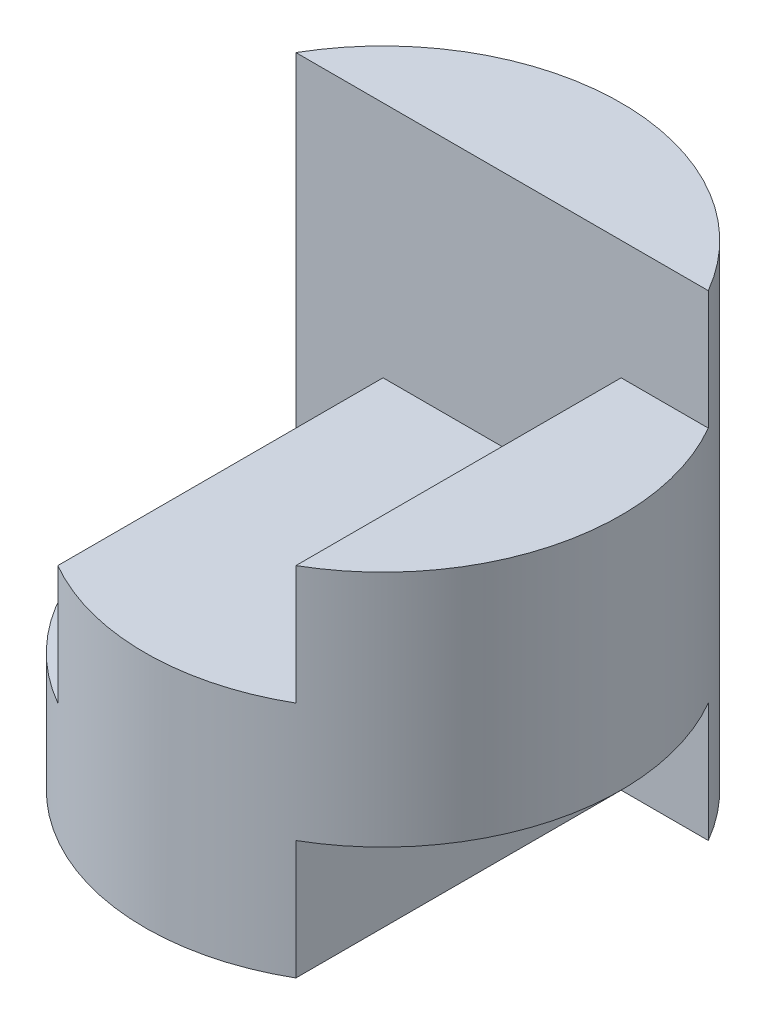
ISO-10303-21;
HEADER;
FILE_DESCRIPTION(('STEP AP214'),'2;1');
FILE_NAME('part.step','',(''),(''),'','','');
FILE_SCHEMA(('AUTOMOTIVE_DESIGN { 1 0 10303 214 1 1 1 1 }'));
ENDSEC;
DATA;
#1=APPLICATION_CONTEXT('core data for automotive mechanical design processes');
#2=APPLICATION_PROTOCOL_DEFINITION('international standard','automotive_design',2000,#1);
#3=PRODUCT_CONTEXT('',#1,'mechanical');
#4=PRODUCT('Part','Part','',(#3));
#5=PRODUCT_RELATED_PRODUCT_CATEGORY('part','',(#4));
#6=PRODUCT_DEFINITION_FORMATION('','',#4);
#7=PRODUCT_DEFINITION_CONTEXT('part definition',#1,'design');
#8=PRODUCT_DEFINITION('design','',#6,#7);
#9=PRODUCT_DEFINITION_SHAPE('','',#8);
#10=(LENGTH_UNIT() NAMED_UNIT(*) SI_UNIT(.MILLI.,.METRE.));
#11=(NAMED_UNIT(*) PLANE_ANGLE_UNIT() SI_UNIT($,.RADIAN.));
#12=(NAMED_UNIT(*) SI_UNIT($,.STERADIAN.) SOLID_ANGLE_UNIT());
#13=UNCERTAINTY_MEASURE_WITH_UNIT(LENGTH_MEASURE(1.E-05),#10,'distance_accuracy_value','');
#14=(GEOMETRIC_REPRESENTATION_CONTEXT(3) GLOBAL_UNCERTAINTY_ASSIGNED_CONTEXT((#13)) GLOBAL_UNIT_ASSIGNED_CONTEXT((#10,
#11,#12)) REPRESENTATION_CONTEXT('',''));
#15=CARTESIAN_POINT('',(0.,0.,0.));
#16=DIRECTION('',(0.,0.,1.));
#17=DIRECTION('',(1.,0.,0.));
#18=AXIS2_PLACEMENT_3D('',#15,#16,#17);
#19=CARTESIAN_POINT('',(0.,4.,0.));
#20=DIRECTION('',(0.,-1.,0.));
#21=DIRECTION('',(0.,0.,-1.));
#22=AXIS2_PLACEMENT_3D('',#19,#20,#21);
#23=CYLINDRICAL_SURFACE('',#22,2.);
#24=DIRECTION('',(0.,-1.,0.));
#25=VECTOR('',#24,1.);
#26=CARTESIAN_POINT('',(-1.73205080756888,4.,-1.));
#27=LINE('',#26,#25);
#28=CARTESIAN_POINT('',(-1.73205080756888,4.,-1.));
#29=VERTEX_POINT('',#28);
#30=CARTESIAN_POINT('',(-1.73205080756888,1.,-1.));
#31=VERTEX_POINT('',#30);
#32=EDGE_CURVE('E149',#29,#31,#27,.T.);
#33=ORIENTED_EDGE('',*,*,#32,.F.);
#34=CARTESIAN_POINT('',(0.,4.,0.));
#35=DIRECTION('',(0.,1.,0.));
#36=DIRECTION('',(0.,0.,1.));
#37=AXIS2_PLACEMENT_3D('',#34,#35,#36);
#38=CIRCLE('',#37,2.);
#39=CARTESIAN_POINT('',(1.73205080756888,4.,-1.));
#40=VERTEX_POINT('',#39);
#41=EDGE_CURVE('E153',#40,#29,#38,.T.);
#42=ORIENTED_EDGE('',*,*,#41,.F.);
#43=DIRECTION('',(0.,-1.,0.));
#44=VECTOR('',#43,1.);
#45=CARTESIAN_POINT('',(1.73205080756888,4.,-1.));
#46=LINE('',#45,#44);
#47=CARTESIAN_POINT('',(1.73205080756888,3.,-1.));
#48=VERTEX_POINT('',#47);
#49=EDGE_CURVE('E47',#48,#40,#46,.F.);
#50=ORIENTED_EDGE('',*,*,#49,.F.);
#51=CARTESIAN_POINT('',(0.,3.,0.));
#52=DIRECTION('',(0.,1.,0.));
#53=DIRECTION('',(0.,0.,1.));
#54=AXIS2_PLACEMENT_3D('',#51,#52,#53);
#55=CIRCLE('',#54,2.);
#56=CARTESIAN_POINT('',(1.,3.,1.73205080756888));
#57=VERTEX_POINT('',#56);
#58=EDGE_CURVE('E161',#57,#48,#55,.T.);
#59=ORIENTED_EDGE('',*,*,#58,.F.);
#60=DIRECTION('',(0.,-1.,0.));
#61=VECTOR('',#60,1.);
#62=CARTESIAN_POINT('',(1.,4.,1.73205080756888));
#63=LINE('',#62,#61);
#64=CARTESIAN_POINT('',(1.,2.,1.73205080756888));
#65=VERTEX_POINT('',#64);
#66=EDGE_CURVE('E163',#65,#57,#63,.F.);
#67=ORIENTED_EDGE('',*,*,#66,.F.);
#68=CARTESIAN_POINT('',(0.,2.,0.));
#69=DIRECTION('',(0.,-1.,0.));
#70=DIRECTION('',(1.,0.,0.));
#71=AXIS2_PLACEMENT_3D('',#68,#69,#70);
#72=CIRCLE('',#71,2.);
#73=CARTESIAN_POINT('',(-1.,2.,1.73205080756888));
#74=VERTEX_POINT('',#73);
#75=EDGE_CURVE('E166',#65,#74,#72,.T.);
#76=ORIENTED_EDGE('',*,*,#75,.T.);
#77=DIRECTION('',(0.,-1.,0.));
#78=VECTOR('',#77,1.);
#79=CARTESIAN_POINT('',(-1.,4.,1.73205080756888));
#80=LINE('',#79,#78);
#81=CARTESIAN_POINT('',(-1.,1.,1.73205080756888));
#82=VERTEX_POINT('',#81);
#83=EDGE_CURVE('E169',#82,#74,#80,.F.);
#84=ORIENTED_EDGE('',*,*,#83,.F.);
#85=CARTESIAN_POINT('',(0.,1.,0.));
#86=DIRECTION('',(0.,1.,0.));
#87=DIRECTION('',(0.,0.,1.));
#88=AXIS2_PLACEMENT_3D('',#85,#86,#87);
#89=CIRCLE('',#88,2.);
#90=EDGE_CURVE('E40',#31,#82,#89,.T.);
#91=ORIENTED_EDGE('',*,*,#90,.F.);
#92=EDGE_LOOP('',(#33,#42,#50,#59,#67,#76,#84,#91));
#93=FACE_BOUND('',#92,.T.);
#94=DIRECTION('',(0.,-1.,0.));
#95=VECTOR('',#94,1.);
#96=CARTESIAN_POINT('',(1.,4.,1.73205080756888));
#97=LINE('',#96,#95);
#98=CARTESIAN_POINT('',(1.,1.,1.73205080756888));
#99=VERTEX_POINT('',#98);
#100=CARTESIAN_POINT('',(1.,0.,1.73205080756888));
#101=VERTEX_POINT('',#100);
#102=EDGE_CURVE('E146',#99,#101,#97,.T.);
#103=ORIENTED_EDGE('',*,*,#102,.F.);
#104=CARTESIAN_POINT('',(0.,1.,0.));
#105=DIRECTION('',(0.,-1.,0.));
#106=DIRECTION('',(0.,0.,-1.));
#107=AXIS2_PLACEMENT_3D('',#104,#105,#106);
#108=CIRCLE('',#107,2.);
#109=CARTESIAN_POINT('',(1.73205080756888,1.,-1.));
#110=VERTEX_POINT('',#109);
#111=EDGE_CURVE('E11',#110,#99,#108,.T.);
#112=ORIENTED_EDGE('',*,*,#111,.F.);
#113=DIRECTION('',(0.,-1.,0.));
#114=VECTOR('',#113,1.);
#115=CARTESIAN_POINT('',(1.73205080756888,4.,-1.));
#116=LINE('',#115,#114);
#117=CARTESIAN_POINT('',(1.73205080756888,0.,-1.));
#118=VERTEX_POINT('',#117);
#119=EDGE_CURVE('E115',#118,#110,#116,.F.);
#120=ORIENTED_EDGE('',*,*,#119,.F.);
#121=CARTESIAN_POINT('',(0.,0.,0.));
#122=DIRECTION('',(0.,1.,0.));
#123=DIRECTION('',(0.,0.,1.));
#124=AXIS2_PLACEMENT_3D('',#121,#122,#123);
#125=CIRCLE('',#124,2.);
#126=EDGE_CURVE('E152',#118,#101,#125,.T.);
#127=ORIENTED_EDGE('',*,*,#126,.T.);
#128=EDGE_LOOP('',(#103,#112,#120,#127));
#129=FACE_BOUND('',#128,.T.);
#130=ADVANCED_FACE('F33',(#93,#129),#23,.T.);
#131=CARTESIAN_POINT('',(0.,4.,0.));
#132=DIRECTION('',(0.,1.,0.));
#133=DIRECTION('',(0.,0.,1.));
#134=AXIS2_PLACEMENT_3D('',#131,#132,#133);
#135=PLANE('',#134);
#136=ORIENTED_EDGE('',*,*,#41,.T.);
#137=DIRECTION('',(1.,0.,0.));
#138=VECTOR('',#137,1.);
#139=CARTESIAN_POINT('',(0.,4.,-1.));
#140=LINE('',#139,#138);
#141=EDGE_CURVE('E159',#29,#40,#140,.T.);
#142=ORIENTED_EDGE('',*,*,#141,.T.);
#143=EDGE_LOOP('',(#136,#142));
#144=FACE_BOUND('',#143,.T.);
#145=ADVANCED_FACE('F197',(#144),#135,.T.);
#146=CARTESIAN_POINT('',(0.,0.,0.));
#147=DIRECTION('',(0.,1.,0.));
#148=DIRECTION('',(0.,0.,1.));
#149=AXIS2_PLACEMENT_3D('',#146,#147,#148);
#150=PLANE('',#149);
#151=DIRECTION('',(0.,0.,-1.));
#152=VECTOR('',#151,1.);
#153=CARTESIAN_POINT('',(1.,0.,0.));
#154=LINE('',#153,#152);
#155=CARTESIAN_POINT('',(1.,0.,-1.));
#156=VERTEX_POINT('',#155);
#157=EDGE_CURVE('E119',#101,#156,#154,.T.);
#158=ORIENTED_EDGE('',*,*,#157,.F.);
#159=ORIENTED_EDGE('',*,*,#126,.F.);
#160=DIRECTION('',(1.,0.,0.));
#161=VECTOR('',#160,1.);
#162=CARTESIAN_POINT('',(0.,0.,-1.));
#163=LINE('',#162,#161);
#164=EDGE_CURVE('E111',#156,#118,#163,.T.);
#165=ORIENTED_EDGE('',*,*,#164,.F.);
#166=EDGE_LOOP('',(#158,#159,#165));
#167=FACE_BOUND('',#166,.T.);
#168=ADVANCED_FACE('F199',(#167),#150,.F.);
#169=CARTESIAN_POINT('',(0.,1.,3.));
#170=DIRECTION('',(0.,-1.,0.));
#171=DIRECTION('',(0.,0.,-1.));
#172=AXIS2_PLACEMENT_3D('',#169,#170,#171);
#173=PLANE('',#172);
#174=ORIENTED_EDGE('',*,*,#111,.T.);
#175=DIRECTION('',(0.,0.,-1.));
#176=VECTOR('',#175,1.);
#177=CARTESIAN_POINT('',(1.,1.,3.));
#178=LINE('',#177,#176);
#179=CARTESIAN_POINT('',(1.,1.,-1.));
#180=VERTEX_POINT('',#179);
#181=EDGE_CURVE('E104',#99,#180,#178,.T.);
#182=ORIENTED_EDGE('',*,*,#181,.T.);
#183=DIRECTION('',(-1.,0.,0.));
#184=VECTOR('',#183,1.);
#185=CARTESIAN_POINT('',(0.,1.,-1.));
#186=LINE('',#185,#184);
#187=EDGE_CURVE('E106',#110,#180,#186,.T.);
#188=ORIENTED_EDGE('',*,*,#187,.F.);
#189=EDGE_LOOP('',(#174,#182,#188));
#190=FACE_BOUND('',#189,.T.);
#191=ADVANCED_FACE('F105',(#190),#173,.T.);
#192=CARTESIAN_POINT('',(1.,0.,3.));
#193=DIRECTION('',(1.,0.,0.));
#194=DIRECTION('',(0.,0.,-1.));
#195=AXIS2_PLACEMENT_3D('',#192,#193,#194);
#196=PLANE('',#195);
#197=ORIENTED_EDGE('',*,*,#102,.T.);
#198=ORIENTED_EDGE('',*,*,#157,.T.);
#199=DIRECTION('',(0.,-1.,0.));
#200=VECTOR('',#199,1.);
#201=CARTESIAN_POINT('',(1.,0.,-1.));
#202=LINE('',#201,#200);
#203=EDGE_CURVE('E55',#180,#156,#202,.T.);
#204=ORIENTED_EDGE('',*,*,#203,.F.);
#205=ORIENTED_EDGE('',*,*,#181,.F.);
#206=EDGE_LOOP('',(#197,#198,#204,#205));
#207=FACE_BOUND('',#206,.T.);
#208=ADVANCED_FACE('F117',(#207),#196,.T.);
#209=CARTESIAN_POINT('',(0.,0.,-1.));
#210=DIRECTION('',(0.,0.,1.));
#211=DIRECTION('',(1.,0.,0.));
#212=AXIS2_PLACEMENT_3D('',#209,#210,#211);
#213=PLANE('',#212);
#214=ORIENTED_EDGE('',*,*,#119,.T.);
#215=ORIENTED_EDGE('',*,*,#187,.T.);
#216=ORIENTED_EDGE('',*,*,#203,.T.);
#217=ORIENTED_EDGE('',*,*,#164,.T.);
#218=EDGE_LOOP('',(#214,#215,#216,#217));
#219=FACE_BOUND('',#218,.T.);
#220=ADVANCED_FACE('F113',(#219),#213,.T.);
#221=CARTESIAN_POINT('',(0.,1.,3.));
#222=DIRECTION('',(0.,1.,0.));
#223=DIRECTION('',(0.,0.,1.));
#224=AXIS2_PLACEMENT_3D('',#221,#222,#223);
#225=PLANE('',#224);
#226=DIRECTION('',(1.,0.,0.));
#227=VECTOR('',#226,1.);
#228=CARTESIAN_POINT('',(0.,1.,-1.));
#229=LINE('',#228,#227);
#230=CARTESIAN_POINT('',(-1.,1.,-1.));
#231=VERTEX_POINT('',#230);
#232=EDGE_CURVE('E110',#31,#231,#229,.T.);
#233=ORIENTED_EDGE('',*,*,#232,.F.);
#234=ORIENTED_EDGE('',*,*,#90,.T.);
#235=DIRECTION('',(0.,0.,-1.));
#236=VECTOR('',#235,1.);
#237=CARTESIAN_POINT('',(-1.,1.,3.));
#238=LINE('',#237,#236);
#239=EDGE_CURVE('E143',#82,#231,#238,.T.);
#240=ORIENTED_EDGE('',*,*,#239,.T.);
#241=EDGE_LOOP('',(#233,#234,#240));
#242=FACE_BOUND('',#241,.T.);
#243=ADVANCED_FACE('F173',(#242),#225,.T.);
#244=CARTESIAN_POINT('',(-1.,0.,3.));
#245=DIRECTION('',(-1.,0.,0.));
#246=DIRECTION('',(0.,0.,1.));
#247=AXIS2_PLACEMENT_3D('',#244,#245,#246);
#248=PLANE('',#247);
#249=ORIENTED_EDGE('',*,*,#83,.T.);
#250=DIRECTION('',(0.,0.,-1.));
#251=VECTOR('',#250,1.);
#252=CARTESIAN_POINT('',(-1.,2.,3.));
#253=LINE('',#252,#251);
#254=CARTESIAN_POINT('',(-1.,2.,-1.));
#255=VERTEX_POINT('',#254);
#256=EDGE_CURVE('E141',#74,#255,#253,.T.);
#257=ORIENTED_EDGE('',*,*,#256,.T.);
#258=DIRECTION('',(0.,1.,0.));
#259=VECTOR('',#258,1.);
#260=CARTESIAN_POINT('',(-1.,0.,-1.));
#261=LINE('',#260,#259);
#262=EDGE_CURVE('E126',#231,#255,#261,.T.);
#263=ORIENTED_EDGE('',*,*,#262,.F.);
#264=ORIENTED_EDGE('',*,*,#239,.F.);
#265=EDGE_LOOP('',(#249,#257,#263,#264));
#266=FACE_BOUND('',#265,.T.);
#267=ADVANCED_FACE('F179',(#266),#248,.T.);
#268=CARTESIAN_POINT('',(0.,2.,3.));
#269=DIRECTION('',(0.,-1.,0.));
#270=DIRECTION('',(1.,0.,0.));
#271=AXIS2_PLACEMENT_3D('',#268,#269,#270);
#272=PLANE('',#271);
#273=DIRECTION('',(0.,0.,-1.));
#274=VECTOR('',#273,1.);
#275=CARTESIAN_POINT('',(1.,2.,3.));
#276=LINE('',#275,#274);
#277=CARTESIAN_POINT('',(1.,2.,-1.));
#278=VERTEX_POINT('',#277);
#279=EDGE_CURVE('E139',#65,#278,#276,.T.);
#280=ORIENTED_EDGE('',*,*,#279,.T.);
#281=DIRECTION('',(-1.,0.,0.));
#282=VECTOR('',#281,1.);
#283=CARTESIAN_POINT('',(0.,2.,-1.));
#284=LINE('',#283,#282);
#285=EDGE_CURVE('E129',#278,#255,#284,.T.);
#286=ORIENTED_EDGE('',*,*,#285,.T.);
#287=ORIENTED_EDGE('',*,*,#256,.F.);
#288=ORIENTED_EDGE('',*,*,#75,.F.);
#289=EDGE_LOOP('',(#280,#286,#287,#288));
#290=FACE_BOUND('',#289,.T.);
#291=ADVANCED_FACE('F185',(#290),#272,.F.);
#292=CARTESIAN_POINT('',(1.,0.,3.));
#293=DIRECTION('',(-1.,0.,0.));
#294=DIRECTION('',(0.,0.,1.));
#295=AXIS2_PLACEMENT_3D('',#292,#293,#294);
#296=PLANE('',#295);
#297=ORIENTED_EDGE('',*,*,#66,.T.);
#298=DIRECTION('',(0.,0.,-1.));
#299=VECTOR('',#298,1.);
#300=CARTESIAN_POINT('',(1.,3.,3.));
#301=LINE('',#300,#299);
#302=CARTESIAN_POINT('',(1.,3.,-1.));
#303=VERTEX_POINT('',#302);
#304=EDGE_CURVE('E137',#57,#303,#301,.T.);
#305=ORIENTED_EDGE('',*,*,#304,.T.);
#306=DIRECTION('',(0.,1.,0.));
#307=VECTOR('',#306,1.);
#308=CARTESIAN_POINT('',(1.,0.,-1.));
#309=LINE('',#308,#307);
#310=EDGE_CURVE('E132',#278,#303,#309,.T.);
#311=ORIENTED_EDGE('',*,*,#310,.F.);
#312=ORIENTED_EDGE('',*,*,#279,.F.);
#313=EDGE_LOOP('',(#297,#305,#311,#312));
#314=FACE_BOUND('',#313,.T.);
#315=ADVANCED_FACE('F189',(#314),#296,.T.);
#316=CARTESIAN_POINT('',(0.,3.,3.));
#317=DIRECTION('',(0.,1.,0.));
#318=DIRECTION('',(0.,0.,1.));
#319=AXIS2_PLACEMENT_3D('',#316,#317,#318);
#320=PLANE('',#319);
#321=ORIENTED_EDGE('',*,*,#304,.F.);
#322=ORIENTED_EDGE('',*,*,#58,.T.);
#323=DIRECTION('',(1.,0.,0.));
#324=VECTOR('',#323,1.);
#325=CARTESIAN_POINT('',(0.,3.,-1.));
#326=LINE('',#325,#324);
#327=EDGE_CURVE('E135',#303,#48,#326,.T.);
#328=ORIENTED_EDGE('',*,*,#327,.F.);
#329=EDGE_LOOP('',(#321,#322,#328));
#330=FACE_BOUND('',#329,.T.);
#331=ADVANCED_FACE('F194',(#330),#320,.T.);
#332=CARTESIAN_POINT('',(0.,0.,-1.));
#333=DIRECTION('',(0.,0.,1.));
#334=DIRECTION('',(1.,0.,0.));
#335=AXIS2_PLACEMENT_3D('',#332,#333,#334);
#336=PLANE('',#335);
#337=ORIENTED_EDGE('',*,*,#32,.T.);
#338=ORIENTED_EDGE('',*,*,#232,.T.);
#339=ORIENTED_EDGE('',*,*,#262,.T.);
#340=ORIENTED_EDGE('',*,*,#285,.F.);
#341=ORIENTED_EDGE('',*,*,#310,.T.);
#342=ORIENTED_EDGE('',*,*,#327,.T.);
#343=ORIENTED_EDGE('',*,*,#49,.T.);
#344=ORIENTED_EDGE('',*,*,#141,.F.);
#345=EDGE_LOOP('',(#337,#338,#339,#340,#341,#342,#343,#344));
#346=FACE_BOUND('',#345,.T.);
#347=ADVANCED_FACE('F192',(#346),#336,.T.);
#348=CLOSED_SHELL('',(#130,#145,#168,#191,#208,#220,#243,#267,#291,#315,#331,#347));
#349=MANIFOLD_SOLID_BREP('B2',#348);
#350=ADVANCED_BREP_SHAPE_REPRESENTATION('',(#18,#349),#14);
#351=SHAPE_DEFINITION_REPRESENTATION(#9,#350);
ENDSEC;
END-ISO-10303-21;
